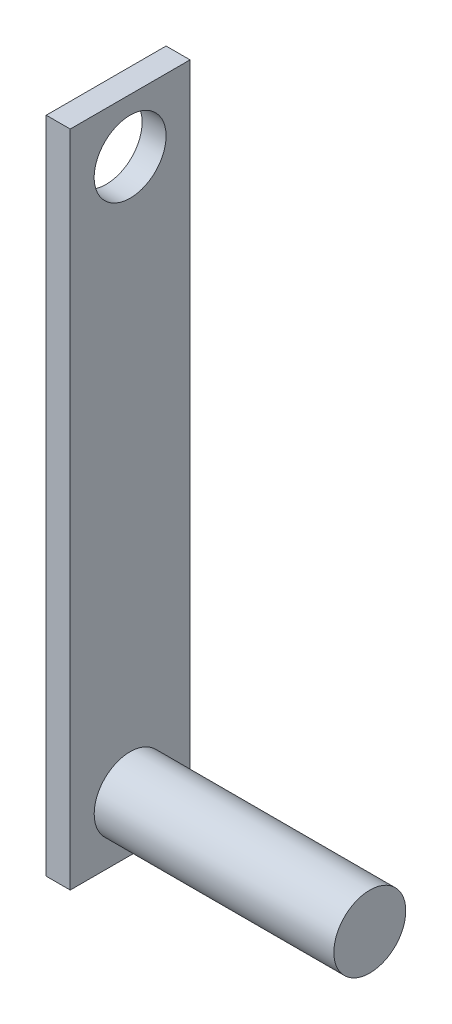
ISO-10303-21;
HEADER;
FILE_DESCRIPTION(('STEP AP214'),'2;1');
FILE_NAME('part.step','',(''),(''),'','','');
FILE_SCHEMA(('AUTOMOTIVE_DESIGN { 1 0 10303 214 1 1 1 1 }'));
ENDSEC;
DATA;
#1=APPLICATION_CONTEXT('core data for automotive mechanical design processes');
#2=APPLICATION_PROTOCOL_DEFINITION('international standard','automotive_design',2000,#1);
#3=PRODUCT_CONTEXT('',#1,'mechanical');
#4=PRODUCT('Part','Part','',(#3));
#5=PRODUCT_RELATED_PRODUCT_CATEGORY('part','',(#4));
#6=PRODUCT_DEFINITION_FORMATION('','',#4);
#7=PRODUCT_DEFINITION_CONTEXT('part definition',#1,'design');
#8=PRODUCT_DEFINITION('design','',#6,#7);
#9=PRODUCT_DEFINITION_SHAPE('','',#8);
#10=(LENGTH_UNIT() NAMED_UNIT(*) SI_UNIT(.MILLI.,.METRE.));
#11=(NAMED_UNIT(*) PLANE_ANGLE_UNIT() SI_UNIT($,.RADIAN.));
#12=(NAMED_UNIT(*) SI_UNIT($,.STERADIAN.) SOLID_ANGLE_UNIT());
#13=UNCERTAINTY_MEASURE_WITH_UNIT(LENGTH_MEASURE(1.E-05),#10,'distance_accuracy_value','');
#14=(GEOMETRIC_REPRESENTATION_CONTEXT(3) GLOBAL_UNCERTAINTY_ASSIGNED_CONTEXT((#13)) GLOBAL_UNIT_ASSIGNED_CONTEXT((#10,
#11,#12)) REPRESENTATION_CONTEXT('',''));
#15=CARTESIAN_POINT('',(0.,0.,0.));
#16=DIRECTION('',(0.,0.,1.));
#17=DIRECTION('',(1.,0.,0.));
#18=AXIS2_PLACEMENT_3D('',#15,#16,#17);
#19=CARTESIAN_POINT('',(2.,0.,0.));
#20=DIRECTION('',(-1.,0.,0.));
#21=DIRECTION('',(0.,0.,1.));
#22=AXIS2_PLACEMENT_3D('',#19,#20,#21);
#23=PLANE('',#22);
#24=DIRECTION('',(0.,1.,0.));
#25=VECTOR('',#24,1.);
#26=CARTESIAN_POINT('',(2.,-27.5,-5.));
#27=LINE('',#26,#25);
#28=CARTESIAN_POINT('',(2.,-27.5,-5.));
#29=VERTEX_POINT('',#28);
#30=CARTESIAN_POINT('',(2.,27.5,-5.));
#31=VERTEX_POINT('',#30);
#32=EDGE_CURVE('E86',#29,#31,#27,.T.);
#33=ORIENTED_EDGE('',*,*,#32,.T.);
#34=DIRECTION('',(0.,0.,1.));
#35=VECTOR('',#34,1.);
#36=CARTESIAN_POINT('',(2.,27.5,5.));
#37=LINE('',#36,#35);
#38=CARTESIAN_POINT('',(2.,27.5,5.));
#39=VERTEX_POINT('',#38);
#40=EDGE_CURVE('E81',#31,#39,#37,.T.);
#41=ORIENTED_EDGE('',*,*,#40,.T.);
#42=DIRECTION('',(0.,-1.,0.));
#43=VECTOR('',#42,1.);
#44=CARTESIAN_POINT('',(2.,-27.5,5.));
#45=LINE('',#44,#43);
#46=CARTESIAN_POINT('',(2.,-27.5,5.));
#47=VERTEX_POINT('',#46);
#48=EDGE_CURVE('E84',#39,#47,#45,.T.);
#49=ORIENTED_EDGE('',*,*,#48,.T.);
#50=DIRECTION('',(0.,0.,-1.));
#51=VECTOR('',#50,1.);
#52=CARTESIAN_POINT('',(2.,-27.5,5.));
#53=LINE('',#52,#51);
#54=EDGE_CURVE('E50',#47,#29,#53,.T.);
#55=ORIENTED_EDGE('',*,*,#54,.T.);
#56=EDGE_LOOP('',(#33,#41,#49,#55));
#57=FACE_BOUND('',#56,.T.);
#58=CARTESIAN_POINT('',(2.,23.,0.));
#59=DIRECTION('',(1.,0.,0.));
#60=DIRECTION('',(0.,0.,-1.));
#61=AXIS2_PLACEMENT_3D('',#58,#59,#60);
#62=CIRCLE('',#61,3.);
#63=CARTESIAN_POINT('',(2.,23.,-3.));
#64=VERTEX_POINT('',#63);
#65=EDGE_CURVE('E143',#64,#64,#62,.T.);
#66=ORIENTED_EDGE('',*,*,#65,.F.);
#67=EDGE_LOOP('',(#66));
#68=FACE_BOUND('',#67,.T.);
#69=CARTESIAN_POINT('',(2.,-23.,0.));
#70=DIRECTION('',(-1.,0.,0.));
#71=DIRECTION('',(0.,0.,1.));
#72=AXIS2_PLACEMENT_3D('',#69,#70,#71);
#73=CIRCLE('',#72,3.);
#74=CARTESIAN_POINT('',(2.,-23.,3.));
#75=VERTEX_POINT('',#74);
#76=EDGE_CURVE('E11',#75,#75,#73,.F.);
#77=ORIENTED_EDGE('',*,*,#76,.F.);
#78=EDGE_LOOP('',(#77));
#79=FACE_BOUND('',#78,.T.);
#80=ADVANCED_FACE('F33',(#57,#68,#79),#23,.F.);
#81=CARTESIAN_POINT('',(2.,-27.5,-5.));
#82=DIRECTION('',(0.,0.,1.));
#83=DIRECTION('',(1.,0.,0.));
#84=AXIS2_PLACEMENT_3D('',#81,#82,#83);
#85=PLANE('',#84);
#86=DIRECTION('',(0.,1.,0.));
#87=VECTOR('',#86,1.);
#88=CARTESIAN_POINT('',(0.,-27.5,-5.));
#89=LINE('',#88,#87);
#90=CARTESIAN_POINT('',(0.,-27.5,-5.));
#91=VERTEX_POINT('',#90);
#92=CARTESIAN_POINT('',(0.,27.5,-5.));
#93=VERTEX_POINT('',#92);
#94=EDGE_CURVE('E100',#91,#93,#89,.T.);
#95=ORIENTED_EDGE('',*,*,#94,.T.);
#96=DIRECTION('',(-1.,0.,0.));
#97=VECTOR('',#96,1.);
#98=CARTESIAN_POINT('',(2.,27.5,-5.));
#99=LINE('',#98,#97);
#100=EDGE_CURVE('E42',#31,#93,#99,.T.);
#101=ORIENTED_EDGE('',*,*,#100,.F.);
#102=ORIENTED_EDGE('',*,*,#32,.F.);
#103=DIRECTION('',(-1.,0.,0.));
#104=VECTOR('',#103,1.);
#105=CARTESIAN_POINT('',(2.,-27.5,-5.));
#106=LINE('',#105,#104);
#107=EDGE_CURVE('E96',#29,#91,#106,.T.);
#108=ORIENTED_EDGE('',*,*,#107,.T.);
#109=EDGE_LOOP('',(#95,#101,#102,#108));
#110=FACE_BOUND('',#109,.T.);
#111=ADVANCED_FACE('F35',(#110),#85,.F.);
#112=CARTESIAN_POINT('',(2.,27.5,5.));
#113=DIRECTION('',(0.,-1.,0.));
#114=DIRECTION('',(0.,0.,-1.));
#115=AXIS2_PLACEMENT_3D('',#112,#113,#114);
#116=PLANE('',#115);
#117=DIRECTION('',(0.,0.,1.));
#118=VECTOR('',#117,1.);
#119=CARTESIAN_POINT('',(0.,27.5,5.));
#120=LINE('',#119,#118);
#121=CARTESIAN_POINT('',(0.,27.5,5.));
#122=VERTEX_POINT('',#121);
#123=EDGE_CURVE('E91',#93,#122,#120,.T.);
#124=ORIENTED_EDGE('',*,*,#123,.T.);
#125=DIRECTION('',(-1.,0.,0.));
#126=VECTOR('',#125,1.);
#127=CARTESIAN_POINT('',(2.,27.5,5.));
#128=LINE('',#127,#126);
#129=EDGE_CURVE('E89',#39,#122,#128,.T.);
#130=ORIENTED_EDGE('',*,*,#129,.F.);
#131=ORIENTED_EDGE('',*,*,#40,.F.);
#132=ORIENTED_EDGE('',*,*,#100,.T.);
#133=EDGE_LOOP('',(#124,#130,#131,#132));
#134=FACE_BOUND('',#133,.T.);
#135=ADVANCED_FACE('F90',(#134),#116,.F.);
#136=CARTESIAN_POINT('',(2.,-27.5,5.));
#137=DIRECTION('',(0.,0.,-1.));
#138=DIRECTION('',(-1.,0.,0.));
#139=AXIS2_PLACEMENT_3D('',#136,#137,#138);
#140=PLANE('',#139);
#141=DIRECTION('',(0.,-1.,0.));
#142=VECTOR('',#141,1.);
#143=CARTESIAN_POINT('',(0.,-27.5,5.));
#144=LINE('',#143,#142);
#145=CARTESIAN_POINT('',(0.,-27.5,5.));
#146=VERTEX_POINT('',#145);
#147=EDGE_CURVE('E67',#122,#146,#144,.T.);
#148=ORIENTED_EDGE('',*,*,#147,.T.);
#149=DIRECTION('',(-1.,0.,0.));
#150=VECTOR('',#149,1.);
#151=CARTESIAN_POINT('',(2.,-27.5,5.));
#152=LINE('',#151,#150);
#153=EDGE_CURVE('E92',#47,#146,#152,.T.);
#154=ORIENTED_EDGE('',*,*,#153,.F.);
#155=ORIENTED_EDGE('',*,*,#48,.F.);
#156=ORIENTED_EDGE('',*,*,#129,.T.);
#157=EDGE_LOOP('',(#148,#154,#155,#156));
#158=FACE_BOUND('',#157,.T.);
#159=ADVANCED_FACE('F94',(#158),#140,.F.);
#160=CARTESIAN_POINT('',(2.,-27.5,5.));
#161=DIRECTION('',(0.,1.,0.));
#162=DIRECTION('',(0.,0.,1.));
#163=AXIS2_PLACEMENT_3D('',#160,#161,#162);
#164=PLANE('',#163);
#165=DIRECTION('',(0.,0.,-1.));
#166=VECTOR('',#165,1.);
#167=CARTESIAN_POINT('',(0.,-27.5,5.));
#168=LINE('',#167,#166);
#169=EDGE_CURVE('E73',#146,#91,#168,.T.);
#170=ORIENTED_EDGE('',*,*,#169,.T.);
#171=ORIENTED_EDGE('',*,*,#107,.F.);
#172=ORIENTED_EDGE('',*,*,#54,.F.);
#173=ORIENTED_EDGE('',*,*,#153,.T.);
#174=EDGE_LOOP('',(#170,#171,#172,#173));
#175=FACE_BOUND('',#174,.T.);
#176=ADVANCED_FACE('F114',(#175),#164,.F.);
#177=CARTESIAN_POINT('',(0.,0.,0.));
#178=DIRECTION('',(-1.,0.,0.));
#179=DIRECTION('',(0.,0.,1.));
#180=AXIS2_PLACEMENT_3D('',#177,#178,#179);
#181=PLANE('',#180);
#182=CARTESIAN_POINT('',(0.,23.,0.));
#183=DIRECTION('',(-1.,0.,0.));
#184=DIRECTION('',(0.,0.,1.));
#185=AXIS2_PLACEMENT_3D('',#182,#183,#184);
#186=CIRCLE('',#185,3.);
#187=CARTESIAN_POINT('',(0.,23.,3.));
#188=VERTEX_POINT('',#187);
#189=EDGE_CURVE('E103',#188,#188,#186,.F.);
#190=ORIENTED_EDGE('',*,*,#189,.T.);
#191=EDGE_LOOP('',(#190));
#192=FACE_BOUND('',#191,.T.);
#193=ORIENTED_EDGE('',*,*,#94,.F.);
#194=ORIENTED_EDGE('',*,*,#169,.F.);
#195=ORIENTED_EDGE('',*,*,#147,.F.);
#196=ORIENTED_EDGE('',*,*,#123,.F.);
#197=EDGE_LOOP('',(#193,#194,#195,#196));
#198=FACE_BOUND('',#197,.T.);
#199=ADVANCED_FACE('F111',(#192,#198),#181,.T.);
#200=CARTESIAN_POINT('',(-8.48528137423857,23.,0.));
#201=DIRECTION('',(1.,0.,0.));
#202=DIRECTION('',(0.,0.,-1.));
#203=AXIS2_PLACEMENT_3D('',#200,#201,#202);
#204=CYLINDRICAL_SURFACE('',#203,3.);
#205=ORIENTED_EDGE('',*,*,#65,.T.);
#206=EDGE_LOOP('',(#205));
#207=FACE_BOUND('',#206,.T.);
#208=ORIENTED_EDGE('',*,*,#189,.F.);
#209=EDGE_LOOP('',(#208));
#210=FACE_BOUND('',#209,.T.);
#211=ADVANCED_FACE('F113',(#207,#210),#204,.F.);
#212=CARTESIAN_POINT('',(22.,-23.,0.));
#213=DIRECTION('',(-1.,0.,0.));
#214=DIRECTION('',(0.,0.,1.));
#215=AXIS2_PLACEMENT_3D('',#212,#213,#214);
#216=CYLINDRICAL_SURFACE('',#215,3.);
#217=CARTESIAN_POINT('',(22.,-23.,0.));
#218=DIRECTION('',(1.,0.,0.));
#219=DIRECTION('',(0.,0.,-1.));
#220=AXIS2_PLACEMENT_3D('',#217,#218,#219);
#221=CIRCLE('',#220,3.);
#222=CARTESIAN_POINT('',(22.,-23.,-3.));
#223=VERTEX_POINT('',#222);
#224=EDGE_CURVE('E142',#223,#223,#221,.T.);
#225=ORIENTED_EDGE('',*,*,#224,.F.);
#226=EDGE_LOOP('',(#225));
#227=FACE_BOUND('',#226,.T.);
#228=ORIENTED_EDGE('',*,*,#76,.T.);
#229=EDGE_LOOP('',(#228));
#230=FACE_BOUND('',#229,.T.);
#231=ADVANCED_FACE('F121',(#227,#230),#216,.T.);
#232=CARTESIAN_POINT('',(22.,-23.,0.));
#233=DIRECTION('',(1.,0.,0.));
#234=DIRECTION('',(0.,0.,-1.));
#235=AXIS2_PLACEMENT_3D('',#232,#233,#234);
#236=PLANE('',#235);
#237=ORIENTED_EDGE('',*,*,#224,.T.);
#238=EDGE_LOOP('',(#237));
#239=FACE_BOUND('',#238,.T.);
#240=ADVANCED_FACE('F134',(#239),#236,.T.);
#241=CLOSED_SHELL('',(#80,#111,#135,#159,#176,#199,#211,#231,#240));
#242=MANIFOLD_SOLID_BREP('B2',#241);
#243=ADVANCED_BREP_SHAPE_REPRESENTATION('',(#18,#242),#14);
#244=SHAPE_DEFINITION_REPRESENTATION(#9,#243);
ENDSEC;
END-ISO-10303-21;
